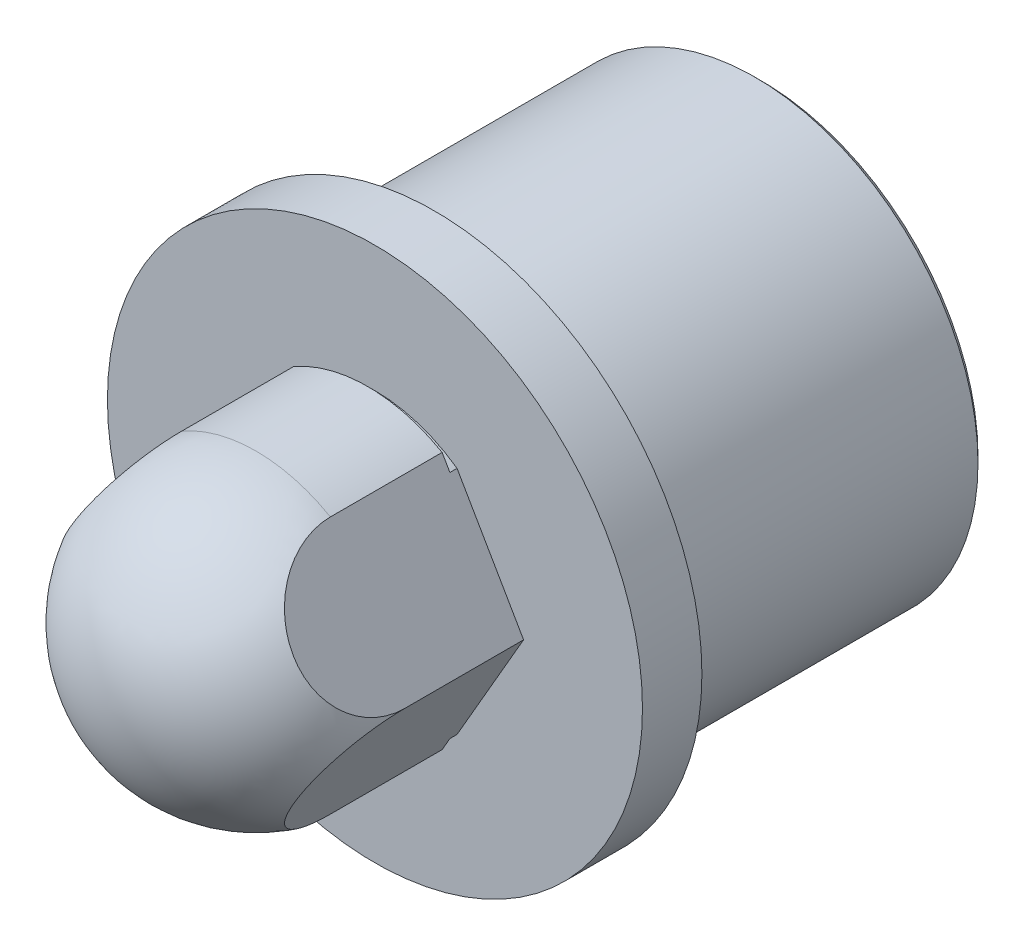
ISO-10303-21;
HEADER;
FILE_DESCRIPTION(('STEP AP214'),'2;1');
FILE_NAME('part.step','',(''),(''),'','','');
FILE_SCHEMA(('AUTOMOTIVE_DESIGN { 1 0 10303 214 1 1 1 1 }'));
ENDSEC;
DATA;
#1=APPLICATION_CONTEXT('core data for automotive mechanical design processes');
#2=APPLICATION_PROTOCOL_DEFINITION('international standard','automotive_design',2000,#1);
#3=PRODUCT_CONTEXT('',#1,'mechanical');
#4=PRODUCT('Part','Part','',(#3));
#5=PRODUCT_RELATED_PRODUCT_CATEGORY('part','',(#4));
#6=PRODUCT_DEFINITION_FORMATION('','',#4);
#7=PRODUCT_DEFINITION_CONTEXT('part definition',#1,'design');
#8=PRODUCT_DEFINITION('design','',#6,#7);
#9=PRODUCT_DEFINITION_SHAPE('','',#8);
#10=(LENGTH_UNIT() NAMED_UNIT(*) SI_UNIT(.MILLI.,.METRE.));
#11=(NAMED_UNIT(*) PLANE_ANGLE_UNIT() SI_UNIT($,.RADIAN.));
#12=(NAMED_UNIT(*) SI_UNIT($,.STERADIAN.) SOLID_ANGLE_UNIT());
#13=UNCERTAINTY_MEASURE_WITH_UNIT(LENGTH_MEASURE(1.E-05),#10,'distance_accuracy_value','');
#14=(GEOMETRIC_REPRESENTATION_CONTEXT(3) GLOBAL_UNCERTAINTY_ASSIGNED_CONTEXT((#13)) GLOBAL_UNIT_ASSIGNED_CONTEXT((#10,
#11,#12)) REPRESENTATION_CONTEXT('',''));
#15=CARTESIAN_POINT('',(0.,0.,0.));
#16=DIRECTION('',(0.,0.,1.));
#17=DIRECTION('',(1.,0.,0.));
#18=AXIS2_PLACEMENT_3D('',#15,#16,#17);
#19=CARTESIAN_POINT('',(0.,0.,11.));
#20=DIRECTION('',(0.,0.,1.));
#21=DIRECTION('',(1.,0.,0.));
#22=AXIS2_PLACEMENT_3D('',#19,#20,#21);
#23=CYLINDRICAL_SURFACE('',#22,4.76);
#24=CARTESIAN_POINT('',(0.,0.,2.));
#25=DIRECTION('',(0.,0.,1.));
#26=DIRECTION('',(1.,0.,0.));
#27=AXIS2_PLACEMENT_3D('',#24,#25,#26);
#28=CIRCLE('',#27,4.76);
#29=CARTESIAN_POINT('',(2.7616174829551,3.87699224629567,2.));
#30=VERTEX_POINT('',#29);
#31=CARTESIAN_POINT('',(-2.7616174829551,3.87699224629567,2.));
#32=VERTEX_POINT('',#31);
#33=EDGE_CURVE('E125',#30,#32,#28,.T.);
#34=ORIENTED_EDGE('',*,*,#33,.T.);
#35=DIRECTION('',(0.,0.,1.));
#36=VECTOR('',#35,1.);
#37=CARTESIAN_POINT('',(-2.7616174829551,3.87699224629567,11.));
#38=LINE('',#37,#36);
#39=CARTESIAN_POINT('',(-2.7616174829551,3.87699224629567,2.24));
#40=VERTEX_POINT('',#39);
#41=EDGE_CURVE('E195',#32,#40,#38,.T.);
#42=ORIENTED_EDGE('',*,*,#41,.T.);
#43=CARTESIAN_POINT('',(0.,0.,2.24));
#44=DIRECTION('',(0.,0.,1.));
#45=DIRECTION('',(1.,0.,0.));
#46=AXIS2_PLACEMENT_3D('',#43,#44,#45);
#47=CIRCLE('',#46,4.76);
#48=CARTESIAN_POINT('',(2.7616174829551,3.87699224629567,2.24));
#49=VERTEX_POINT('',#48);
#50=EDGE_CURVE('E127',#49,#40,#47,.T.);
#51=ORIENTED_EDGE('',*,*,#50,.F.);
#52=DIRECTION('',(0.,0.,1.));
#53=VECTOR('',#52,1.);
#54=CARTESIAN_POINT('',(2.7616174829551,3.87699224629567,11.));
#55=LINE('',#54,#53);
#56=EDGE_CURVE('E114',#49,#30,#55,.F.);
#57=ORIENTED_EDGE('',*,*,#56,.T.);
#58=EDGE_LOOP('',(#34,#42,#51,#57));
#59=FACE_BOUND('',#58,.T.);
#60=ADVANCED_FACE('F35',(#59),#23,.T.);
#61=CARTESIAN_POINT('',(-2.7616174829551,-3.87699224629567,2.24));
#62=VERTEX_POINT('',#61);
#63=CARTESIAN_POINT('',(2.7616174829551,-3.87699224629567,2.24));
#64=VERTEX_POINT('',#63);
#65=EDGE_CURVE('E142',#62,#64,#47,.T.);
#66=ORIENTED_EDGE('',*,*,#65,.F.);
#67=DIRECTION('',(0.,0.,1.));
#68=VECTOR('',#67,1.);
#69=CARTESIAN_POINT('',(-2.7616174829551,-3.87699224629567,11.));
#70=LINE('',#69,#68);
#71=CARTESIAN_POINT('',(-2.7616174829551,-3.87699224629567,2.));
#72=VERTEX_POINT('',#71);
#73=EDGE_CURVE('E202',#62,#72,#70,.F.);
#74=ORIENTED_EDGE('',*,*,#73,.T.);
#75=CARTESIAN_POINT('',(2.7616174829551,-3.87699224629567,2.));
#76=VERTEX_POINT('',#75);
#77=EDGE_CURVE('E135',#72,#76,#28,.T.);
#78=ORIENTED_EDGE('',*,*,#77,.T.);
#79=DIRECTION('',(0.,0.,1.));
#80=VECTOR('',#79,1.);
#81=CARTESIAN_POINT('',(2.7616174829551,-3.87699224629567,11.));
#82=LINE('',#81,#80);
#83=EDGE_CURVE('E209',#76,#64,#82,.T.);
#84=ORIENTED_EDGE('',*,*,#83,.T.);
#85=EDGE_LOOP('',(#66,#74,#78,#84));
#86=FACE_BOUND('',#85,.T.);
#87=ADVANCED_FACE('F225',(#86),#23,.T.);
#88=CARTESIAN_POINT('',(0.,5.,2.24));
#89=DIRECTION('',(0.,0.,1.));
#90=DIRECTION('',(1.,0.,0.));
#91=AXIS2_PLACEMENT_3D('',#88,#89,#90);
#92=PLANE('',#91);
#93=ORIENTED_EDGE('',*,*,#50,.T.);
#94=DIRECTION('',(0.500000000000001,0.866025403784438,0.));
#95=VECTOR('',#94,1.);
#96=CARTESIAN_POINT('',(-1.5849364905389,5.91506350946109,2.24));
#97=LINE('',#96,#95);
#98=CARTESIAN_POINT('',(-2.49999999999999,4.3301270189222,2.24));
#99=VERTEX_POINT('',#98);
#100=EDGE_CURVE('E197',#40,#99,#97,.T.);
#101=ORIENTED_EDGE('',*,*,#100,.T.);
#102=CARTESIAN_POINT('',(0.,0.,2.24));
#103=DIRECTION('',(0.,0.,1.));
#104=DIRECTION('',(1.,0.,0.));
#105=AXIS2_PLACEMENT_3D('',#102,#103,#104);
#106=CIRCLE('',#105,5.);
#107=CARTESIAN_POINT('',(2.49999999999999,4.3301270189222,2.24));
#108=VERTEX_POINT('',#107);
#109=EDGE_CURVE('E186',#108,#99,#106,.T.);
#110=ORIENTED_EDGE('',*,*,#109,.F.);
#111=DIRECTION('',(0.500000000000001,-0.866025403784438,0.));
#112=VECTOR('',#111,1.);
#113=CARTESIAN_POINT('',(1.5849364905389,5.91506350946109,2.24));
#114=LINE('',#113,#112);
#115=EDGE_CURVE('E129',#108,#49,#114,.T.);
#116=ORIENTED_EDGE('',*,*,#115,.T.);
#117=EDGE_LOOP('',(#93,#101,#110,#116));
#118=FACE_BOUND('',#117,.T.);
#119=ADVANCED_FACE('F229',(#118),#92,.F.);
#120=CARTESIAN_POINT('',(-2.49999999999999,-4.3301270189222,2.24));
#121=VERTEX_POINT('',#120);
#122=CARTESIAN_POINT('',(2.49999999999999,-4.3301270189222,2.24));
#123=VERTEX_POINT('',#122);
#124=EDGE_CURVE('E173',#121,#123,#106,.T.);
#125=ORIENTED_EDGE('',*,*,#124,.F.);
#126=DIRECTION('',(-0.500000000000001,0.866025403784438,0.));
#127=VECTOR('',#126,1.);
#128=CARTESIAN_POINT('',(-5.9150635094611,1.58493649053889,2.24));
#129=LINE('',#128,#127);
#130=EDGE_CURVE('E183',#121,#62,#129,.T.);
#131=ORIENTED_EDGE('',*,*,#130,.T.);
#132=ORIENTED_EDGE('',*,*,#65,.T.);
#133=DIRECTION('',(-0.500000000000001,-0.866025403784438,0.));
#134=VECTOR('',#133,1.);
#135=CARTESIAN_POINT('',(5.9150635094611,1.58493649053889,2.24));
#136=LINE('',#135,#134);
#137=EDGE_CURVE('E185',#64,#123,#136,.T.);
#138=ORIENTED_EDGE('',*,*,#137,.T.);
#139=EDGE_LOOP('',(#125,#131,#132,#138));
#140=FACE_BOUND('',#139,.T.);
#141=ADVANCED_FACE('F181',(#140),#92,.F.);
#142=CARTESIAN_POINT('',(0.,0.,11.));
#143=DIRECTION('',(0.,0.,1.));
#144=DIRECTION('',(1.,0.,0.));
#145=AXIS2_PLACEMENT_3D('',#142,#143,#144);
#146=CYLINDRICAL_SURFACE('',#145,5.);
#147=ORIENTED_EDGE('',*,*,#109,.T.);
#148=DIRECTION('',(0.,0.,1.));
#149=VECTOR('',#148,1.);
#150=CARTESIAN_POINT('',(-2.49999999999999,4.3301270189222,11.));
#151=LINE('',#150,#149);
#152=CARTESIAN_POINT('',(-2.49999999999999,4.3301270189222,6.));
#153=VERTEX_POINT('',#152);
#154=EDGE_CURVE('E12',#99,#153,#151,.T.);
#155=ORIENTED_EDGE('',*,*,#154,.T.);
#156=CARTESIAN_POINT('',(0.,0.,6.));
#157=DIRECTION('',(0.,0.,1.));
#158=DIRECTION('',(1.,0.,0.));
#159=AXIS2_PLACEMENT_3D('',#156,#157,#158);
#160=CIRCLE('',#159,5.);
#161=CARTESIAN_POINT('',(2.49999999999999,4.3301270189222,6.));
#162=VERTEX_POINT('',#161);
#163=EDGE_CURVE('E187',#162,#153,#160,.T.);
#164=ORIENTED_EDGE('',*,*,#163,.F.);
#165=DIRECTION('',(0.,0.,1.));
#166=VECTOR('',#165,1.);
#167=CARTESIAN_POINT('',(2.49999999999999,4.3301270189222,11.));
#168=LINE('',#167,#166);
#169=EDGE_CURVE('E162',#162,#108,#168,.F.);
#170=ORIENTED_EDGE('',*,*,#169,.T.);
#171=EDGE_LOOP('',(#147,#155,#164,#170));
#172=FACE_BOUND('',#171,.T.);
#173=ADVANCED_FACE('F233',(#172),#146,.T.);
#174=CARTESIAN_POINT('',(0.,0.,6.));
#175=DIRECTION('',(0.,0.,1.));
#176=DIRECTION('',(0.,1.,0.));
#177=AXIS2_PLACEMENT_3D('',#174,#175,#176);
#178=SPHERICAL_SURFACE('',#177,5.);
#179=ORIENTED_EDGE('',*,*,#163,.T.);
#180=CARTESIAN_POINT('',(-3.74999999999999,2.1650635094611,6.));
#181=DIRECTION('',(0.866025403784438,-0.500000000000001,0.));
#182=DIRECTION('',(0.500000000000001,0.866025403784438,0.));
#183=AXIS2_PLACEMENT_3D('',#180,#181,#182);
#184=CIRCLE('',#183,2.5);
#185=CARTESIAN_POINT('',(-5.,0.,6.));
#186=VERTEX_POINT('',#185);
#187=EDGE_CURVE('E192',#153,#186,#184,.T.);
#188=ORIENTED_EDGE('',*,*,#187,.T.);
#189=CARTESIAN_POINT('',(-3.75,-2.1650635094611,6.));
#190=DIRECTION('',(0.866025403784438,0.500000000000001,0.));
#191=DIRECTION('',(-0.500000000000001,0.866025403784438,0.));
#192=AXIS2_PLACEMENT_3D('',#189,#190,#191);
#193=CIRCLE('',#192,2.5);
#194=CARTESIAN_POINT('',(-2.49999999999999,-4.3301270189222,6.));
#195=VERTEX_POINT('',#194);
#196=EDGE_CURVE('E200',#186,#195,#193,.T.);
#197=ORIENTED_EDGE('',*,*,#196,.T.);
#198=CARTESIAN_POINT('',(2.49999999999999,-4.3301270189222,6.));
#199=VERTEX_POINT('',#198);
#200=EDGE_CURVE('E175',#195,#199,#160,.T.);
#201=ORIENTED_EDGE('',*,*,#200,.T.);
#202=CARTESIAN_POINT('',(3.75,-2.1650635094611,6.));
#203=DIRECTION('',(-0.866025403784438,0.500000000000001,0.));
#204=DIRECTION('',(-0.500000000000001,-0.866025403784438,0.));
#205=AXIS2_PLACEMENT_3D('',#202,#203,#204);
#206=CIRCLE('',#205,2.5);
#207=CARTESIAN_POINT('',(5.,0.,6.));
#208=VERTEX_POINT('',#207);
#209=EDGE_CURVE('E206',#199,#208,#206,.T.);
#210=ORIENTED_EDGE('',*,*,#209,.T.);
#211=CARTESIAN_POINT('',(3.74999999999999,2.1650635094611,6.));
#212=DIRECTION('',(-0.866025403784438,-0.500000000000001,0.));
#213=DIRECTION('',(0.500000000000001,-0.866025403784438,0.));
#214=AXIS2_PLACEMENT_3D('',#211,#212,#213);
#215=CIRCLE('',#214,2.5);
#216=EDGE_CURVE('E128',#208,#162,#215,.T.);
#217=ORIENTED_EDGE('',*,*,#216,.T.);
#218=EDGE_LOOP('',(#179,#188,#197,#201,#210,#217));
#219=FACE_BOUND('',#218,.T.);
#220=ADVANCED_FACE('F37',(#219),#178,.T.);
#221=CARTESIAN_POINT('',(0.,7.28786796564404,-11.));
#222=DIRECTION('',(0.,0.,1.));
#223=DIRECTION('',(1.,0.,0.));
#224=AXIS2_PLACEMENT_3D('',#221,#222,#223);
#225=PLANE('',#224);
#226=CARTESIAN_POINT('',(0.,0.,-11.));
#227=DIRECTION('',(0.,0.,1.));
#228=DIRECTION('',(1.,0.,0.));
#229=AXIS2_PLACEMENT_3D('',#226,#227,#228);
#230=CIRCLE('',#229,7.28786796564404);
#231=CARTESIAN_POINT('',(7.28786796564404,0.,-11.));
#232=VERTEX_POINT('',#231);
#233=EDGE_CURVE('E159',#232,#232,#230,.T.);
#234=ORIENTED_EDGE('',*,*,#233,.F.);
#235=EDGE_LOOP('',(#234));
#236=FACE_BOUND('',#235,.T.);
#237=ADVANCED_FACE('F276',(#236),#225,.F.);
#238=CARTESIAN_POINT('',(0.,0.,-11.));
#239=DIRECTION('',(0.,0.,1.));
#240=DIRECTION('',(1.,0.,0.));
#241=AXIS2_PLACEMENT_3D('',#238,#239,#240);
#242=CONICAL_SURFACE('',#241,7.28786796564404,0.785398163397442);
#243=CARTESIAN_POINT('',(0.,0.,-10.787867965644));
#244=DIRECTION('',(0.,0.,1.));
#245=DIRECTION('',(1.,0.,0.));
#246=AXIS2_PLACEMENT_3D('',#243,#244,#245);
#247=CIRCLE('',#246,7.5);
#248=CARTESIAN_POINT('',(7.5,0.,-10.787867965644));
#249=VERTEX_POINT('',#248);
#250=EDGE_CURVE('E156',#249,#249,#247,.T.);
#251=ORIENTED_EDGE('',*,*,#250,.F.);
#252=EDGE_LOOP('',(#251));
#253=FACE_BOUND('',#252,.T.);
#254=ORIENTED_EDGE('',*,*,#233,.T.);
#255=EDGE_LOOP('',(#254));
#256=FACE_BOUND('',#255,.T.);
#257=ADVANCED_FACE('F273',(#253,#256),#242,.T.);
#258=CARTESIAN_POINT('',(0.,0.,11.));
#259=DIRECTION('',(0.,0.,1.));
#260=DIRECTION('',(1.,0.,0.));
#261=AXIS2_PLACEMENT_3D('',#258,#259,#260);
#262=CYLINDRICAL_SURFACE('',#261,7.5);
#263=CARTESIAN_POINT('',(0.,0.,-0.239999999999999));
#264=DIRECTION('',(0.,0.,1.));
#265=DIRECTION('',(1.,0.,0.));
#266=AXIS2_PLACEMENT_3D('',#263,#264,#265);
#267=CIRCLE('',#266,7.5);
#268=CARTESIAN_POINT('',(7.5,0.,-0.239999999999999));
#269=VERTEX_POINT('',#268);
#270=EDGE_CURVE('E153',#269,#269,#267,.T.);
#271=ORIENTED_EDGE('',*,*,#270,.F.);
#272=EDGE_LOOP('',(#271));
#273=FACE_BOUND('',#272,.T.);
#274=ORIENTED_EDGE('',*,*,#250,.T.);
#275=EDGE_LOOP('',(#274));
#276=FACE_BOUND('',#275,.T.);
#277=ADVANCED_FACE('F269',(#273,#276),#262,.T.);
#278=CARTESIAN_POINT('',(0.,7.26,-0.24));
#279=DIRECTION('',(0.,0.,-1.));
#280=DIRECTION('',(-1.,0.,0.));
#281=AXIS2_PLACEMENT_3D('',#278,#279,#280);
#282=PLANE('',#281);
#283=CARTESIAN_POINT('',(0.,0.,-0.240000000000001));
#284=DIRECTION('',(0.,0.,1.));
#285=DIRECTION('',(1.,0.,0.));
#286=AXIS2_PLACEMENT_3D('',#283,#284,#285);
#287=CIRCLE('',#286,7.26);
#288=CARTESIAN_POINT('',(7.26,0.,-0.240000000000001));
#289=VERTEX_POINT('',#288);
#290=EDGE_CURVE('E150',#289,#289,#287,.T.);
#291=ORIENTED_EDGE('',*,*,#290,.F.);
#292=EDGE_LOOP('',(#291));
#293=FACE_BOUND('',#292,.T.);
#294=ORIENTED_EDGE('',*,*,#270,.T.);
#295=EDGE_LOOP('',(#294));
#296=FACE_BOUND('',#295,.T.);
#297=ADVANCED_FACE('F265',(#293,#296),#282,.F.);
#298=CARTESIAN_POINT('',(0.,0.,11.));
#299=DIRECTION('',(0.,0.,1.));
#300=DIRECTION('',(1.,0.,0.));
#301=AXIS2_PLACEMENT_3D('',#298,#299,#300);
#302=CYLINDRICAL_SURFACE('',#301,7.26);
#303=CARTESIAN_POINT('',(0.,0.,0.));
#304=DIRECTION('',(0.,0.,1.));
#305=DIRECTION('',(1.,0.,0.));
#306=AXIS2_PLACEMENT_3D('',#303,#304,#305);
#307=CIRCLE('',#306,7.26);
#308=CARTESIAN_POINT('',(7.26,0.,0.));
#309=VERTEX_POINT('',#308);
#310=EDGE_CURVE('E147',#309,#309,#307,.T.);
#311=ORIENTED_EDGE('',*,*,#310,.F.);
#312=EDGE_LOOP('',(#311));
#313=FACE_BOUND('',#312,.T.);
#314=ORIENTED_EDGE('',*,*,#290,.T.);
#315=EDGE_LOOP('',(#314));
#316=FACE_BOUND('',#315,.T.);
#317=ADVANCED_FACE('F261',(#313,#316),#302,.T.);
#318=CARTESIAN_POINT('',(0.,9.,0.));
#319=DIRECTION('',(0.,0.,1.));
#320=DIRECTION('',(1.,0.,0.));
#321=AXIS2_PLACEMENT_3D('',#318,#319,#320);
#322=PLANE('',#321);
#323=CARTESIAN_POINT('',(0.,0.,0.));
#324=DIRECTION('',(0.,0.,1.));
#325=DIRECTION('',(1.,0.,0.));
#326=AXIS2_PLACEMENT_3D('',#323,#324,#325);
#327=CIRCLE('',#326,9.);
#328=CARTESIAN_POINT('',(9.,0.,0.));
#329=VERTEX_POINT('',#328);
#330=EDGE_CURVE('E138',#329,#329,#327,.T.);
#331=ORIENTED_EDGE('',*,*,#330,.F.);
#332=EDGE_LOOP('',(#331));
#333=FACE_BOUND('',#332,.T.);
#334=ORIENTED_EDGE('',*,*,#310,.T.);
#335=EDGE_LOOP('',(#334));
#336=FACE_BOUND('',#335,.T.);
#337=ADVANCED_FACE('F257',(#333,#336),#322,.F.);
#338=CARTESIAN_POINT('',(0.,0.,11.));
#339=DIRECTION('',(0.,0.,1.));
#340=DIRECTION('',(1.,0.,0.));
#341=AXIS2_PLACEMENT_3D('',#338,#339,#340);
#342=CYLINDRICAL_SURFACE('',#341,9.);
#343=CARTESIAN_POINT('',(0.,0.,2.));
#344=DIRECTION('',(0.,0.,1.));
#345=DIRECTION('',(1.,0.,0.));
#346=AXIS2_PLACEMENT_3D('',#343,#344,#345);
#347=CIRCLE('',#346,9.);
#348=CARTESIAN_POINT('',(9.,0.,2.));
#349=VERTEX_POINT('',#348);
#350=EDGE_CURVE('E134',#349,#349,#347,.T.);
#351=ORIENTED_EDGE('',*,*,#350,.F.);
#352=EDGE_LOOP('',(#351));
#353=FACE_BOUND('',#352,.T.);
#354=ORIENTED_EDGE('',*,*,#330,.T.);
#355=EDGE_LOOP('',(#354));
#356=FACE_BOUND('',#355,.T.);
#357=ADVANCED_FACE('F254',(#353,#356),#342,.T.);
#358=CARTESIAN_POINT('',(0.,4.76,2.));
#359=DIRECTION('',(0.,0.,-1.));
#360=DIRECTION('',(-1.,0.,0.));
#361=AXIS2_PLACEMENT_3D('',#358,#359,#360);
#362=PLANE('',#361);
#363=DIRECTION('',(-0.500000000000001,0.866025403784438,0.));
#364=VECTOR('',#363,1.);
#365=CARTESIAN_POINT('',(2.49999999999999,4.3301270189222,2.));
#366=LINE('',#365,#364);
#367=CARTESIAN_POINT('',(5.,0.,2.));
#368=VERTEX_POINT('',#367);
#369=EDGE_CURVE('E50',#368,#30,#366,.T.);
#370=ORIENTED_EDGE('',*,*,#369,.F.);
#371=DIRECTION('',(0.500000000000001,0.866025403784438,0.));
#372=VECTOR('',#371,1.);
#373=CARTESIAN_POINT('',(5.,0.,2.));
#374=LINE('',#373,#372);
#375=EDGE_CURVE('E119',#76,#368,#374,.T.);
#376=ORIENTED_EDGE('',*,*,#375,.F.);
#377=ORIENTED_EDGE('',*,*,#77,.F.);
#378=DIRECTION('',(0.500000000000001,-0.866025403784438,0.));
#379=VECTOR('',#378,1.);
#380=CARTESIAN_POINT('',(-5.,0.,2.));
#381=LINE('',#380,#379);
#382=CARTESIAN_POINT('',(-5.,0.,2.));
#383=VERTEX_POINT('',#382);
#384=EDGE_CURVE('E220',#383,#72,#381,.T.);
#385=ORIENTED_EDGE('',*,*,#384,.F.);
#386=DIRECTION('',(-0.500000000000001,-0.866025403784438,0.));
#387=VECTOR('',#386,1.);
#388=CARTESIAN_POINT('',(-2.49999999999999,4.3301270189222,2.));
#389=LINE('',#388,#387);
#390=EDGE_CURVE('E58',#32,#383,#389,.T.);
#391=ORIENTED_EDGE('',*,*,#390,.F.);
#392=ORIENTED_EDGE('',*,*,#33,.F.);
#393=EDGE_LOOP('',(#370,#376,#377,#385,#391,#392));
#394=FACE_BOUND('',#393,.T.);
#395=ORIENTED_EDGE('',*,*,#350,.T.);
#396=EDGE_LOOP('',(#395));
#397=FACE_BOUND('',#396,.T.);
#398=ADVANCED_FACE('F131',(#394,#397),#362,.F.);
#399=ORIENTED_EDGE('',*,*,#200,.F.);
#400=DIRECTION('',(0.,0.,1.));
#401=VECTOR('',#400,1.);
#402=CARTESIAN_POINT('',(-2.49999999999999,-4.3301270189222,11.));
#403=LINE('',#402,#401);
#404=EDGE_CURVE('E43',#195,#121,#403,.F.);
#405=ORIENTED_EDGE('',*,*,#404,.T.);
#406=ORIENTED_EDGE('',*,*,#124,.T.);
#407=DIRECTION('',(0.,0.,1.));
#408=VECTOR('',#407,1.);
#409=CARTESIAN_POINT('',(2.49999999999999,-4.3301270189222,11.));
#410=LINE('',#409,#408);
#411=EDGE_CURVE('E165',#123,#199,#410,.T.);
#412=ORIENTED_EDGE('',*,*,#411,.T.);
#413=EDGE_LOOP('',(#399,#405,#406,#412));
#414=FACE_BOUND('',#413,.T.);
#415=ADVANCED_FACE('F172',(#414),#146,.T.);
#416=CARTESIAN_POINT('',(2.49999999999999,4.3301270189222,11.));
#417=DIRECTION('',(-0.866025403784438,-0.500000000000001,0.));
#418=DIRECTION('',(0.500000000000001,-0.866025403784438,0.));
#419=AXIS2_PLACEMENT_3D('',#416,#417,#418);
#420=PLANE('',#419);
#421=DIRECTION('',(0.,0.,-1.));
#422=VECTOR('',#421,1.);
#423=CARTESIAN_POINT('',(5.,0.,11.));
#424=LINE('',#423,#422);
#425=EDGE_CURVE('E117',#208,#368,#424,.T.);
#426=ORIENTED_EDGE('',*,*,#425,.T.);
#427=ORIENTED_EDGE('',*,*,#369,.T.);
#428=ORIENTED_EDGE('',*,*,#56,.F.);
#429=ORIENTED_EDGE('',*,*,#115,.F.);
#430=ORIENTED_EDGE('',*,*,#169,.F.);
#431=ORIENTED_EDGE('',*,*,#216,.F.);
#432=EDGE_LOOP('',(#426,#427,#428,#429,#430,#431));
#433=FACE_BOUND('',#432,.T.);
#434=ADVANCED_FACE('F113',(#433),#420,.F.);
#435=CARTESIAN_POINT('',(5.,0.,11.));
#436=DIRECTION('',(-0.866025403784438,0.500000000000001,0.));
#437=DIRECTION('',(-0.500000000000001,-0.866025403784438,0.));
#438=AXIS2_PLACEMENT_3D('',#435,#436,#437);
#439=PLANE('',#438);
#440=ORIENTED_EDGE('',*,*,#411,.F.);
#441=ORIENTED_EDGE('',*,*,#137,.F.);
#442=ORIENTED_EDGE('',*,*,#83,.F.);
#443=ORIENTED_EDGE('',*,*,#375,.T.);
#444=ORIENTED_EDGE('',*,*,#425,.F.);
#445=ORIENTED_EDGE('',*,*,#209,.F.);
#446=EDGE_LOOP('',(#440,#441,#442,#443,#444,#445));
#447=FACE_BOUND('',#446,.T.);
#448=ADVANCED_FACE('F227',(#447),#439,.F.);
#449=CARTESIAN_POINT('',(-2.49999999999999,4.3301270189222,11.));
#450=DIRECTION('',(0.866025403784438,-0.500000000000001,0.));
#451=DIRECTION('',(0.500000000000001,0.866025403784438,0.));
#452=AXIS2_PLACEMENT_3D('',#449,#450,#451);
#453=PLANE('',#452);
#454=ORIENTED_EDGE('',*,*,#154,.F.);
#455=ORIENTED_EDGE('',*,*,#100,.F.);
#456=ORIENTED_EDGE('',*,*,#41,.F.);
#457=ORIENTED_EDGE('',*,*,#390,.T.);
#458=DIRECTION('',(0.,0.,-1.));
#459=VECTOR('',#458,1.);
#460=CARTESIAN_POINT('',(-5.,0.,11.));
#461=LINE('',#460,#459);
#462=EDGE_CURVE('E216',#186,#383,#461,.T.);
#463=ORIENTED_EDGE('',*,*,#462,.F.);
#464=ORIENTED_EDGE('',*,*,#187,.F.);
#465=EDGE_LOOP('',(#454,#455,#456,#457,#463,#464));
#466=FACE_BOUND('',#465,.T.);
#467=ADVANCED_FACE('F235',(#466),#453,.F.);
#468=CARTESIAN_POINT('',(-5.,0.,11.));
#469=DIRECTION('',(0.866025403784438,0.500000000000001,0.));
#470=DIRECTION('',(-0.500000000000001,0.866025403784438,0.));
#471=AXIS2_PLACEMENT_3D('',#468,#469,#470);
#472=PLANE('',#471);
#473=ORIENTED_EDGE('',*,*,#462,.T.);
#474=ORIENTED_EDGE('',*,*,#384,.T.);
#475=ORIENTED_EDGE('',*,*,#73,.F.);
#476=ORIENTED_EDGE('',*,*,#130,.F.);
#477=ORIENTED_EDGE('',*,*,#404,.F.);
#478=ORIENTED_EDGE('',*,*,#196,.F.);
#479=EDGE_LOOP('',(#473,#474,#475,#476,#477,#478));
#480=FACE_BOUND('',#479,.T.);
#481=ADVANCED_FACE('F222',(#480),#472,.F.);
#482=CLOSED_SHELL('',(#60,#87,#119,#141,#173,#220,#237,#257,#277,#297,#317,#337,#357,#398,#415,
#434,#448,#467,#481));
#483=MANIFOLD_SOLID_BREP('B2',#482);
#484=ADVANCED_BREP_SHAPE_REPRESENTATION('',(#18,#483),#14);
#485=SHAPE_DEFINITION_REPRESENTATION(#9,#484);
ENDSEC;
END-ISO-10303-21;
